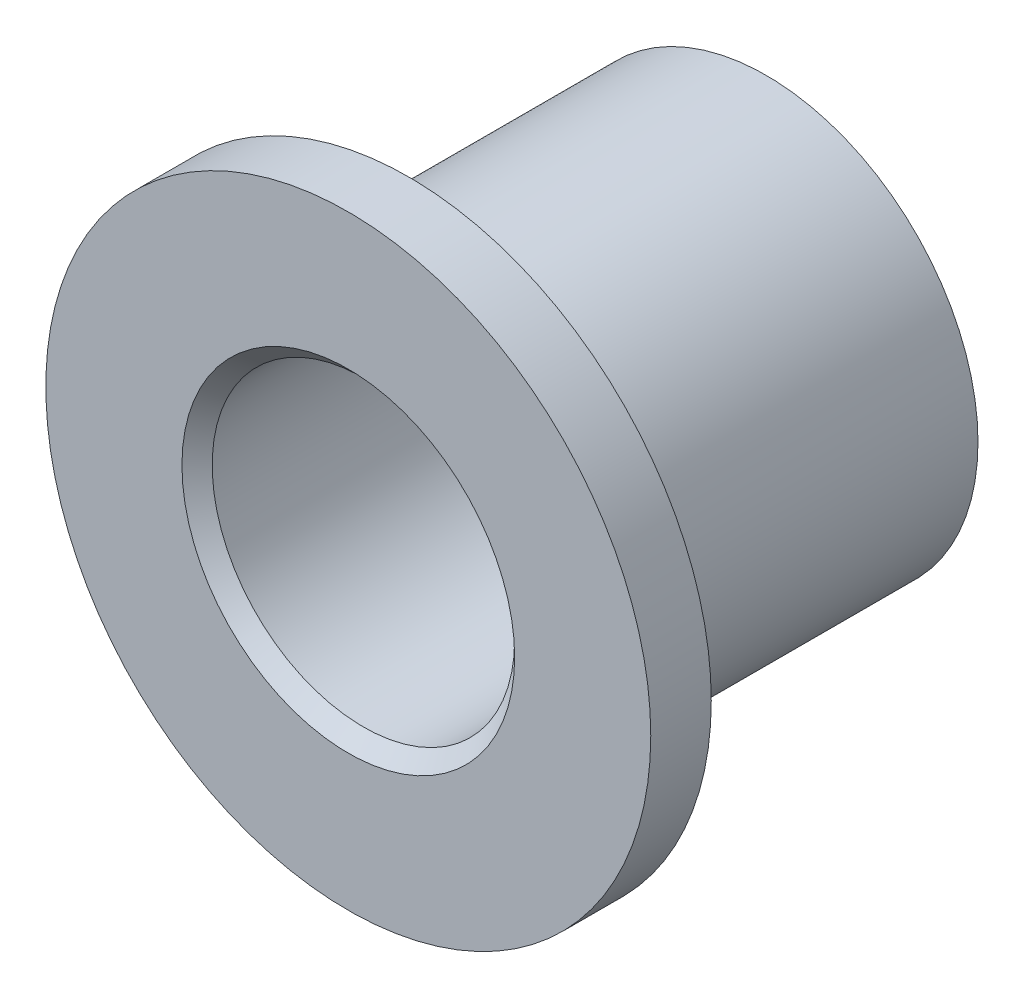
ISO-10303-21;
HEADER;
FILE_DESCRIPTION(('STEP AP214'),'2;1');
FILE_NAME('part.step','',(''),(''),'','','');
FILE_SCHEMA(('AUTOMOTIVE_DESIGN { 1 0 10303 214 1 1 1 1 }'));
ENDSEC;
DATA;
#1=APPLICATION_CONTEXT('core data for automotive mechanical design processes');
#2=APPLICATION_PROTOCOL_DEFINITION('international standard','automotive_design',2000,#1);
#3=PRODUCT_CONTEXT('',#1,'mechanical');
#4=PRODUCT('Part','Part','',(#3));
#5=PRODUCT_RELATED_PRODUCT_CATEGORY('part','',(#4));
#6=PRODUCT_DEFINITION_FORMATION('','',#4);
#7=PRODUCT_DEFINITION_CONTEXT('part definition',#1,'design');
#8=PRODUCT_DEFINITION('design','',#6,#7);
#9=PRODUCT_DEFINITION_SHAPE('','',#8);
#10=(LENGTH_UNIT() NAMED_UNIT(*) SI_UNIT(.MILLI.,.METRE.));
#11=(NAMED_UNIT(*) PLANE_ANGLE_UNIT() SI_UNIT($,.RADIAN.));
#12=(NAMED_UNIT(*) SI_UNIT($,.STERADIAN.) SOLID_ANGLE_UNIT());
#13=UNCERTAINTY_MEASURE_WITH_UNIT(LENGTH_MEASURE(1.E-05),#10,'distance_accuracy_value','');
#14=(GEOMETRIC_REPRESENTATION_CONTEXT(3) GLOBAL_UNCERTAINTY_ASSIGNED_CONTEXT((#13)) GLOBAL_UNIT_ASSIGNED_CONTEXT((#10,
#11,#12)) REPRESENTATION_CONTEXT('',''));
#15=CARTESIAN_POINT('',(0.,0.,0.));
#16=DIRECTION('',(0.,0.,1.));
#17=DIRECTION('',(1.,0.,0.));
#18=AXIS2_PLACEMENT_3D('',#15,#16,#17);
#19=CARTESIAN_POINT('',(0.,0.,6.));
#20=DIRECTION('',(0.,0.,-1.));
#21=DIRECTION('',(-1.,0.,0.));
#22=AXIS2_PLACEMENT_3D('',#19,#20,#21);
#23=CYLINDRICAL_SURFACE('',#22,3.5);
#24=CARTESIAN_POINT('',(0.,0.,0.0909925585665505));
#25=DIRECTION('',(0.,0.,1.));
#26=DIRECTION('',(1.,0.,0.));
#27=AXIS2_PLACEMENT_3D('',#24,#25,#26);
#28=CIRCLE('',#27,3.5);
#29=CARTESIAN_POINT('',(3.5,0.,0.0909925585665505));
#30=VERTEX_POINT('',#29);
#31=EDGE_CURVE('E58',#30,#30,#28,.T.);
#32=ORIENTED_EDGE('',*,*,#31,.T.);
#33=EDGE_LOOP('',(#32));
#34=FACE_BOUND('',#33,.T.);
#35=CARTESIAN_POINT('',(0.,0.,5.6));
#36=DIRECTION('',(0.,0.,1.));
#37=DIRECTION('',(1.,0.,0.));
#38=AXIS2_PLACEMENT_3D('',#35,#36,#37);
#39=CIRCLE('',#38,3.5);
#40=CARTESIAN_POINT('',(3.5,0.,5.6));
#41=VERTEX_POINT('',#40);
#42=EDGE_CURVE('E61',#41,#41,#39,.F.);
#43=ORIENTED_EDGE('',*,*,#42,.T.);
#44=EDGE_LOOP('',(#43));
#45=FACE_BOUND('',#44,.T.);
#46=ADVANCED_FACE('F35',(#34,#45),#23,.T.);
#47=CARTESIAN_POINT('',(0.,0.,0.));
#48=DIRECTION('',(0.,0.,1.));
#49=DIRECTION('',(1.,0.,0.));
#50=AXIS2_PLACEMENT_3D('',#47,#48,#49);
#51=PLANE('',#50);
#52=CARTESIAN_POINT('',(0.,0.,0.));
#53=DIRECTION('',(0.,0.,1.));
#54=DIRECTION('',(1.,0.,0.));
#55=AXIS2_PLACEMENT_3D('',#52,#53,#54);
#56=CIRCLE('',#55,2.75);
#57=CARTESIAN_POINT('',(2.75,0.,0.));
#58=VERTEX_POINT('',#57);
#59=EDGE_CURVE('E50',#58,#58,#56,.T.);
#60=ORIENTED_EDGE('',*,*,#59,.T.);
#61=EDGE_LOOP('',(#60));
#62=FACE_BOUND('',#61,.T.);
#63=CARTESIAN_POINT('',(0.,0.,0.));
#64=DIRECTION('',(0.,0.,1.));
#65=DIRECTION('',(1.,0.,0.));
#66=AXIS2_PLACEMENT_3D('',#63,#64,#65);
#67=CIRCLE('',#66,3.25);
#68=CARTESIAN_POINT('',(3.25,0.,0.));
#69=VERTEX_POINT('',#68);
#70=EDGE_CURVE('E55',#69,#69,#67,.F.);
#71=ORIENTED_EDGE('',*,*,#70,.T.);
#72=EDGE_LOOP('',(#71));
#73=FACE_BOUND('',#72,.T.);
#74=ADVANCED_FACE('F79',(#62,#73),#51,.F.);
#75=CARTESIAN_POINT('',(0.,0.,7.));
#76=DIRECTION('',(0.,0.,-1.));
#77=DIRECTION('',(-1.,0.,0.));
#78=AXIS2_PLACEMENT_3D('',#75,#76,#77);
#79=CYLINDRICAL_SURFACE('',#78,5.);
#80=CARTESIAN_POINT('',(0.,0.,7.));
#81=DIRECTION('',(0.,0.,1.));
#82=DIRECTION('',(1.,0.,0.));
#83=AXIS2_PLACEMENT_3D('',#80,#81,#82);
#84=CIRCLE('',#83,5.);
#85=CARTESIAN_POINT('',(5.,0.,7.));
#86=VERTEX_POINT('',#85);
#87=EDGE_CURVE('E67',#86,#86,#84,.T.);
#88=ORIENTED_EDGE('',*,*,#87,.F.);
#89=EDGE_LOOP('',(#88));
#90=FACE_BOUND('',#89,.T.);
#91=CARTESIAN_POINT('',(0.,0.,6.));
#92=DIRECTION('',(0.,0.,1.));
#93=DIRECTION('',(1.,0.,0.));
#94=AXIS2_PLACEMENT_3D('',#91,#92,#93);
#95=CIRCLE('',#94,5.);
#96=CARTESIAN_POINT('',(5.,0.,6.));
#97=VERTEX_POINT('',#96);
#98=EDGE_CURVE('E68',#97,#97,#95,.T.);
#99=ORIENTED_EDGE('',*,*,#98,.T.);
#100=EDGE_LOOP('',(#99));
#101=FACE_BOUND('',#100,.T.);
#102=ADVANCED_FACE('F76',(#90,#101),#79,.T.);
#103=CARTESIAN_POINT('',(0.,0.,7.));
#104=DIRECTION('',(0.,0.,1.));
#105=DIRECTION('',(1.,0.,0.));
#106=AXIS2_PLACEMENT_3D('',#103,#104,#105);
#107=PLANE('',#106);
#108=CARTESIAN_POINT('',(0.,0.,7.));
#109=DIRECTION('',(0.,0.,1.));
#110=DIRECTION('',(1.,0.,0.));
#111=AXIS2_PLACEMENT_3D('',#108,#109,#110);
#112=CIRCLE('',#111,2.75);
#113=CARTESIAN_POINT('',(2.75,0.,7.));
#114=VERTEX_POINT('',#113);
#115=EDGE_CURVE('E10',#114,#114,#112,.F.);
#116=ORIENTED_EDGE('',*,*,#115,.T.);
#117=EDGE_LOOP('',(#116));
#118=FACE_BOUND('',#117,.T.);
#119=ORIENTED_EDGE('',*,*,#87,.T.);
#120=EDGE_LOOP('',(#119));
#121=FACE_BOUND('',#120,.T.);
#122=ADVANCED_FACE('F74',(#118,#121),#107,.T.);
#123=CARTESIAN_POINT('',(0.,0.,6.));
#124=DIRECTION('',(0.,0.,1.));
#125=DIRECTION('',(1.,0.,0.));
#126=AXIS2_PLACEMENT_3D('',#123,#124,#125);
#127=PLANE('',#126);
#128=CARTESIAN_POINT('',(0.,0.,6.));
#129=DIRECTION('',(0.,0.,1.));
#130=DIRECTION('',(1.,0.,0.));
#131=AXIS2_PLACEMENT_3D('',#128,#129,#130);
#132=CIRCLE('',#131,3.9);
#133=CARTESIAN_POINT('',(3.9,0.,6.));
#134=VERTEX_POINT('',#133);
#135=EDGE_CURVE('E64',#134,#134,#132,.T.);
#136=ORIENTED_EDGE('',*,*,#135,.T.);
#137=EDGE_LOOP('',(#136));
#138=FACE_BOUND('',#137,.T.);
#139=ORIENTED_EDGE('',*,*,#98,.F.);
#140=EDGE_LOOP('',(#139));
#141=FACE_BOUND('',#140,.T.);
#142=ADVANCED_FACE('F83',(#138,#141),#127,.F.);
#143=CARTESIAN_POINT('',(0.,0.,0.));
#144=DIRECTION('',(0.,0.,1.));
#145=DIRECTION('',(1.,0.,0.));
#146=AXIS2_PLACEMENT_3D('',#143,#144,#145);
#147=CYLINDRICAL_SURFACE('',#146,2.5);
#148=CARTESIAN_POINT('',(0.,0.,6.75));
#149=DIRECTION('',(0.,0.,1.));
#150=DIRECTION('',(1.,0.,0.));
#151=AXIS2_PLACEMENT_3D('',#148,#149,#150);
#152=CIRCLE('',#151,2.5);
#153=CARTESIAN_POINT('',(2.5,0.,6.75));
#154=VERTEX_POINT('',#153);
#155=EDGE_CURVE('E42',#154,#154,#152,.T.);
#156=ORIENTED_EDGE('',*,*,#155,.T.);
#157=EDGE_LOOP('',(#156));
#158=FACE_BOUND('',#157,.T.);
#159=CARTESIAN_POINT('',(0.,0.,0.249999999999999));
#160=DIRECTION('',(0.,0.,1.));
#161=DIRECTION('',(1.,0.,0.));
#162=AXIS2_PLACEMENT_3D('',#159,#160,#161);
#163=CIRCLE('',#162,2.5);
#164=CARTESIAN_POINT('',(2.5,0.,0.249999999999999));
#165=VERTEX_POINT('',#164);
#166=EDGE_CURVE('E46',#165,#165,#163,.F.);
#167=ORIENTED_EDGE('',*,*,#166,.T.);
#168=EDGE_LOOP('',(#167));
#169=FACE_BOUND('',#168,.T.);
#170=ADVANCED_FACE('F85',(#158,#169),#147,.F.);
#171=CARTESIAN_POINT('',(0.,0.,5.6));
#172=DIRECTION('',(0.,0.,1.));
#173=DIRECTION('',(1.,0.,0.));
#174=AXIS2_PLACEMENT_3D('',#171,#172,#173);
#175=TOROIDAL_SURFACE('',#174,3.9,0.4);
#176=ORIENTED_EDGE('',*,*,#42,.F.);
#177=EDGE_LOOP('',(#176));
#178=FACE_BOUND('',#177,.T.);
#179=ORIENTED_EDGE('',*,*,#135,.F.);
#180=EDGE_LOOP('',(#179));
#181=FACE_BOUND('',#180,.T.);
#182=ADVANCED_FACE('F92',(#178,#181),#175,.F.);
#183=CARTESIAN_POINT('',(0.,0.,0.0909925585665505));
#184=DIRECTION('',(0.,0.,1.));
#185=DIRECTION('',(1.,0.,0.));
#186=AXIS2_PLACEMENT_3D('',#183,#184,#185);
#187=CONICAL_SURFACE('',#186,3.5,1.22173047639604);
#188=ORIENTED_EDGE('',*,*,#70,.F.);
#189=EDGE_LOOP('',(#188));
#190=FACE_BOUND('',#189,.T.);
#191=ORIENTED_EDGE('',*,*,#31,.F.);
#192=EDGE_LOOP('',(#191));
#193=FACE_BOUND('',#192,.T.);
#194=ADVANCED_FACE('F107',(#190,#193),#187,.T.);
#195=CARTESIAN_POINT('',(0.,0.,0.));
#196=DIRECTION('',(0.,0.,-1.));
#197=DIRECTION('',(-1.,0.,0.));
#198=AXIS2_PLACEMENT_3D('',#195,#196,#197);
#199=CONICAL_SURFACE('',#198,2.75,0.785398163397448);
#200=ORIENTED_EDGE('',*,*,#166,.F.);
#201=EDGE_LOOP('',(#200));
#202=FACE_BOUND('',#201,.T.);
#203=ORIENTED_EDGE('',*,*,#59,.F.);
#204=EDGE_LOOP('',(#203));
#205=FACE_BOUND('',#204,.T.);
#206=ADVANCED_FACE('F110',(#202,#205),#199,.F.);
#207=CARTESIAN_POINT('',(0.,0.,6.75));
#208=DIRECTION('',(0.,0.,1.));
#209=DIRECTION('',(1.,0.,0.));
#210=AXIS2_PLACEMENT_3D('',#207,#208,#209);
#211=CONICAL_SURFACE('',#210,2.5,0.785398163397446);
#212=ORIENTED_EDGE('',*,*,#115,.F.);
#213=EDGE_LOOP('',(#212));
#214=FACE_BOUND('',#213,.T.);
#215=ORIENTED_EDGE('',*,*,#155,.F.);
#216=EDGE_LOOP('',(#215));
#217=FACE_BOUND('',#216,.T.);
#218=ADVANCED_FACE('F37',(#214,#217),#211,.F.);
#219=CLOSED_SHELL('',(#46,#74,#102,#122,#142,#170,#182,#194,#206,#218));
#220=MANIFOLD_SOLID_BREP('B2',#219);
#221=ADVANCED_BREP_SHAPE_REPRESENTATION('',(#18,#220),#14);
#222=SHAPE_DEFINITION_REPRESENTATION(#9,#221);
ENDSEC;
END-ISO-10303-21;
